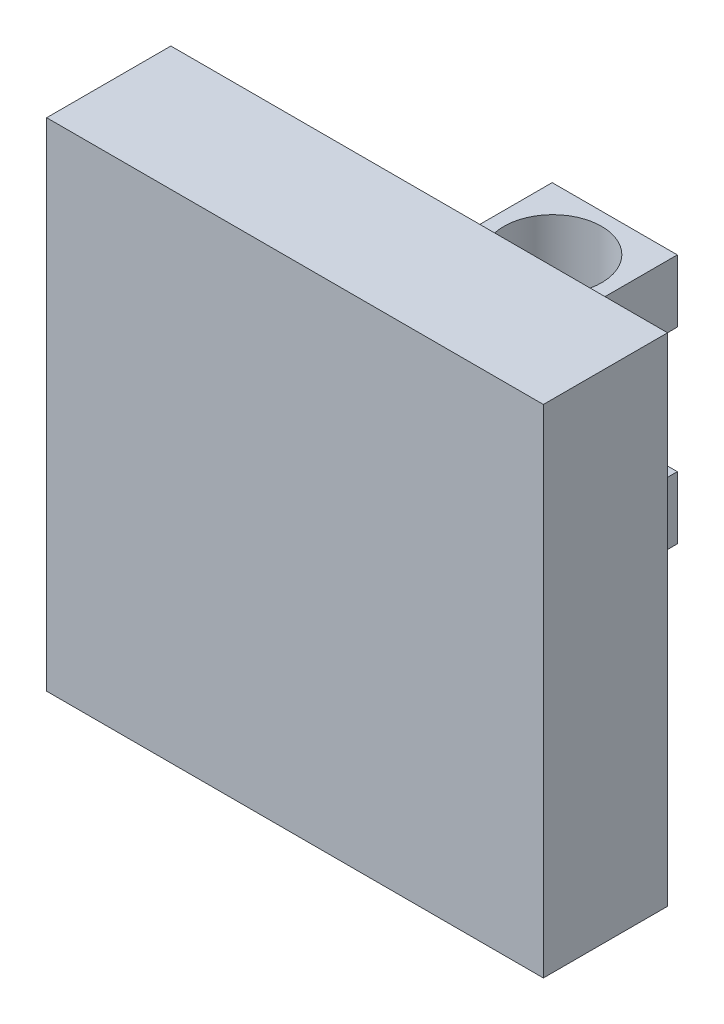
ISO-10303-21;
HEADER;
FILE_DESCRIPTION(('STEP AP214'),'2;1');
FILE_NAME('part.step','',(''),(''),'','','');
FILE_SCHEMA(('AUTOMOTIVE_DESIGN { 1 0 10303 214 1 1 1 1 }'));
ENDSEC;
DATA;
#1=APPLICATION_CONTEXT('core data for automotive mechanical design processes');
#2=APPLICATION_PROTOCOL_DEFINITION('international standard','automotive_design',2000,#1);
#3=PRODUCT_CONTEXT('',#1,'mechanical');
#4=PRODUCT('Part','Part','',(#3));
#5=PRODUCT_RELATED_PRODUCT_CATEGORY('part','',(#4));
#6=PRODUCT_DEFINITION_FORMATION('','',#4);
#7=PRODUCT_DEFINITION_CONTEXT('part definition',#1,'design');
#8=PRODUCT_DEFINITION('design','',#6,#7);
#9=PRODUCT_DEFINITION_SHAPE('','',#8);
#10=(LENGTH_UNIT() NAMED_UNIT(*) SI_UNIT(.MILLI.,.METRE.));
#11=(NAMED_UNIT(*) PLANE_ANGLE_UNIT() SI_UNIT($,.RADIAN.));
#12=(NAMED_UNIT(*) SI_UNIT($,.STERADIAN.) SOLID_ANGLE_UNIT());
#13=UNCERTAINTY_MEASURE_WITH_UNIT(LENGTH_MEASURE(1.E-05),#10,'distance_accuracy_value','');
#14=(GEOMETRIC_REPRESENTATION_CONTEXT(3) GLOBAL_UNCERTAINTY_ASSIGNED_CONTEXT((#13)) GLOBAL_UNIT_ASSIGNED_CONTEXT((#10,
#11,#12)) REPRESENTATION_CONTEXT('',''));
#15=CARTESIAN_POINT('',(0.,0.,0.));
#16=DIRECTION('',(0.,0.,1.));
#17=DIRECTION('',(1.,0.,0.));
#18=AXIS2_PLACEMENT_3D('',#15,#16,#17);
#19=CARTESIAN_POINT('',(0.,0.,0.));
#20=DIRECTION('',(0.,0.,-1.));
#21=DIRECTION('',(-1.,0.,0.));
#22=AXIS2_PLACEMENT_3D('',#19,#20,#21);
#23=PLANE('',#22);
#24=DIRECTION('',(0.,1.,0.));
#25=VECTOR('',#24,1.);
#26=CARTESIAN_POINT('',(12.7,-12.7,0.));
#27=LINE('',#26,#25);
#28=CARTESIAN_POINT('',(12.7,-12.7,0.));
#29=VERTEX_POINT('',#28);
#30=CARTESIAN_POINT('',(12.7,12.7,0.));
#31=VERTEX_POINT('',#30);
#32=EDGE_CURVE('E179',#29,#31,#27,.T.);
#33=ORIENTED_EDGE('',*,*,#32,.F.);
#34=DIRECTION('',(1.,0.,0.));
#35=VECTOR('',#34,1.);
#36=CARTESIAN_POINT('',(-12.7,-12.7,0.));
#37=LINE('',#36,#35);
#38=CARTESIAN_POINT('',(-12.7,-12.7,0.));
#39=VERTEX_POINT('',#38);
#40=EDGE_CURVE('E184',#39,#29,#37,.T.);
#41=ORIENTED_EDGE('',*,*,#40,.F.);
#42=DIRECTION('',(0.,-1.,0.));
#43=VECTOR('',#42,1.);
#44=CARTESIAN_POINT('',(-12.7,-12.7,0.));
#45=LINE('',#44,#43);
#46=CARTESIAN_POINT('',(-12.7,12.7,0.));
#47=VERTEX_POINT('',#46);
#48=EDGE_CURVE('E195',#47,#39,#45,.T.);
#49=ORIENTED_EDGE('',*,*,#48,.F.);
#50=DIRECTION('',(-1.,0.,0.));
#51=VECTOR('',#50,1.);
#52=CARTESIAN_POINT('',(-12.7,12.7,0.));
#53=LINE('',#52,#51);
#54=EDGE_CURVE('E193',#31,#47,#53,.T.);
#55=ORIENTED_EDGE('',*,*,#54,.F.);
#56=EDGE_LOOP('',(#33,#41,#49,#55));
#57=FACE_BOUND('',#56,.T.);
#58=DIRECTION('',(1.,0.,0.));
#59=VECTOR('',#58,1.);
#60=CARTESIAN_POINT('',(3.2,-3.2,0.));
#61=LINE('',#60,#59);
#62=CARTESIAN_POINT('',(-3.2,-3.2,0.));
#63=VERTEX_POINT('',#62);
#64=CARTESIAN_POINT('',(3.2,-3.2,0.));
#65=VERTEX_POINT('',#64);
#66=EDGE_CURVE('E151',#63,#65,#61,.T.);
#67=ORIENTED_EDGE('',*,*,#66,.F.);
#68=DIRECTION('',(0.,1.,0.));
#69=VECTOR('',#68,1.);
#70=CARTESIAN_POINT('',(-3.2,-3.2,0.));
#71=LINE('',#70,#69);
#72=CARTESIAN_POINT('',(-3.2,-6.4,0.));
#73=VERTEX_POINT('',#72);
#74=EDGE_CURVE('E148',#73,#63,#71,.T.);
#75=ORIENTED_EDGE('',*,*,#74,.F.);
#76=DIRECTION('',(-1.,0.,0.));
#77=VECTOR('',#76,1.);
#78=CARTESIAN_POINT('',(-3.2,-6.4,0.));
#79=LINE('',#78,#77);
#80=CARTESIAN_POINT('',(3.2,-6.4,0.));
#81=VERTEX_POINT('',#80);
#82=EDGE_CURVE('E160',#81,#73,#79,.T.);
#83=ORIENTED_EDGE('',*,*,#82,.F.);
#84=DIRECTION('',(0.,-1.,0.));
#85=VECTOR('',#84,1.);
#86=CARTESIAN_POINT('',(3.2,-3.2,0.));
#87=LINE('',#86,#85);
#88=EDGE_CURVE('E168',#65,#81,#87,.T.);
#89=ORIENTED_EDGE('',*,*,#88,.F.);
#90=EDGE_LOOP('',(#67,#75,#83,#89));
#91=FACE_BOUND('',#90,.T.);
#92=DIRECTION('',(0.,1.,0.));
#93=VECTOR('',#92,1.);
#94=CARTESIAN_POINT('',(-3.2,3.2,0.));
#95=LINE('',#94,#93);
#96=CARTESIAN_POINT('',(-3.2,3.2,0.));
#97=VERTEX_POINT('',#96);
#98=CARTESIAN_POINT('',(-3.2,6.4,0.));
#99=VERTEX_POINT('',#98);
#100=EDGE_CURVE('E295',#97,#99,#95,.T.);
#101=ORIENTED_EDGE('',*,*,#100,.F.);
#102=DIRECTION('',(-1.,0.,0.));
#103=VECTOR('',#102,1.);
#104=CARTESIAN_POINT('',(3.2,3.2,0.));
#105=LINE('',#104,#103);
#106=CARTESIAN_POINT('',(3.2,3.2,0.));
#107=VERTEX_POINT('',#106);
#108=EDGE_CURVE('E146',#107,#97,#105,.T.);
#109=ORIENTED_EDGE('',*,*,#108,.F.);
#110=DIRECTION('',(0.,-1.,0.));
#111=VECTOR('',#110,1.);
#112=CARTESIAN_POINT('',(3.2,3.2,0.));
#113=LINE('',#112,#111);
#114=CARTESIAN_POINT('',(3.2,6.4,0.));
#115=VERTEX_POINT('',#114);
#116=EDGE_CURVE('E142',#115,#107,#113,.T.);
#117=ORIENTED_EDGE('',*,*,#116,.F.);
#118=DIRECTION('',(1.,0.,0.));
#119=VECTOR('',#118,1.);
#120=CARTESIAN_POINT('',(3.2,6.4,0.));
#121=LINE('',#120,#119);
#122=EDGE_CURVE('E305',#99,#115,#121,.T.);
#123=ORIENTED_EDGE('',*,*,#122,.F.);
#124=EDGE_LOOP('',(#101,#109,#117,#123));
#125=FACE_BOUND('',#124,.T.);
#126=ADVANCED_FACE('F33',(#57,#91,#125),#23,.T.);
#127=CARTESIAN_POINT('',(12.7,-12.7,6.35));
#128=DIRECTION('',(-1.,0.,0.));
#129=DIRECTION('',(0.,0.,1.));
#130=AXIS2_PLACEMENT_3D('',#127,#128,#129);
#131=PLANE('',#130);
#132=ORIENTED_EDGE('',*,*,#32,.T.);
#133=DIRECTION('',(0.,0.,-1.));
#134=VECTOR('',#133,1.);
#135=CARTESIAN_POINT('',(12.7,12.7,6.35));
#136=LINE('',#135,#134);
#137=CARTESIAN_POINT('',(12.7,12.7,6.35));
#138=VERTEX_POINT('',#137);
#139=EDGE_CURVE('E11',#138,#31,#136,.T.);
#140=ORIENTED_EDGE('',*,*,#139,.F.);
#141=DIRECTION('',(0.,1.,0.));
#142=VECTOR('',#141,1.);
#143=CARTESIAN_POINT('',(12.7,-12.7,6.35));
#144=LINE('',#143,#142);
#145=CARTESIAN_POINT('',(12.7,-12.7,6.35));
#146=VERTEX_POINT('',#145);
#147=EDGE_CURVE('E180',#146,#138,#144,.T.);
#148=ORIENTED_EDGE('',*,*,#147,.F.);
#149=DIRECTION('',(0.,0.,-1.));
#150=VECTOR('',#149,1.);
#151=CARTESIAN_POINT('',(12.7,-12.7,6.35));
#152=LINE('',#151,#150);
#153=EDGE_CURVE('E190',#146,#29,#152,.T.);
#154=ORIENTED_EDGE('',*,*,#153,.T.);
#155=EDGE_LOOP('',(#132,#140,#148,#154));
#156=FACE_BOUND('',#155,.T.);
#157=ADVANCED_FACE('F35',(#156),#131,.F.);
#158=CARTESIAN_POINT('',(-12.7,12.7,6.35));
#159=DIRECTION('',(0.,-1.,0.));
#160=DIRECTION('',(0.,0.,-1.));
#161=AXIS2_PLACEMENT_3D('',#158,#159,#160);
#162=PLANE('',#161);
#163=ORIENTED_EDGE('',*,*,#54,.T.);
#164=DIRECTION('',(0.,0.,-1.));
#165=VECTOR('',#164,1.);
#166=CARTESIAN_POINT('',(-12.7,12.7,6.35));
#167=LINE('',#166,#165);
#168=CARTESIAN_POINT('',(-12.7,12.7,6.35));
#169=VERTEX_POINT('',#168);
#170=EDGE_CURVE('E41',#169,#47,#167,.T.);
#171=ORIENTED_EDGE('',*,*,#170,.F.);
#172=DIRECTION('',(-1.,0.,0.));
#173=VECTOR('',#172,1.);
#174=CARTESIAN_POINT('',(-12.7,12.7,6.35));
#175=LINE('',#174,#173);
#176=EDGE_CURVE('E183',#138,#169,#175,.T.);
#177=ORIENTED_EDGE('',*,*,#176,.F.);
#178=ORIENTED_EDGE('',*,*,#139,.T.);
#179=EDGE_LOOP('',(#163,#171,#177,#178));
#180=FACE_BOUND('',#179,.T.);
#181=ADVANCED_FACE('F223',(#180),#162,.F.);
#182=CARTESIAN_POINT('',(-12.7,-12.7,6.35));
#183=DIRECTION('',(1.,0.,0.));
#184=DIRECTION('',(0.,0.,-1.));
#185=AXIS2_PLACEMENT_3D('',#182,#183,#184);
#186=PLANE('',#185);
#187=ORIENTED_EDGE('',*,*,#48,.T.);
#188=DIRECTION('',(0.,0.,-1.));
#189=VECTOR('',#188,1.);
#190=CARTESIAN_POINT('',(-12.7,-12.7,6.35));
#191=LINE('',#190,#189);
#192=CARTESIAN_POINT('',(-12.7,-12.7,6.35));
#193=VERTEX_POINT('',#192);
#194=EDGE_CURVE('E200',#193,#39,#191,.T.);
#195=ORIENTED_EDGE('',*,*,#194,.F.);
#196=DIRECTION('',(0.,-1.,0.));
#197=VECTOR('',#196,1.);
#198=CARTESIAN_POINT('',(-12.7,-12.7,6.35));
#199=LINE('',#198,#197);
#200=EDGE_CURVE('E186',#169,#193,#199,.T.);
#201=ORIENTED_EDGE('',*,*,#200,.F.);
#202=ORIENTED_EDGE('',*,*,#170,.T.);
#203=EDGE_LOOP('',(#187,#195,#201,#202));
#204=FACE_BOUND('',#203,.T.);
#205=ADVANCED_FACE('F207',(#204),#186,.F.);
#206=CARTESIAN_POINT('',(-12.7,-12.7,6.35));
#207=DIRECTION('',(0.,1.,0.));
#208=DIRECTION('',(0.,0.,1.));
#209=AXIS2_PLACEMENT_3D('',#206,#207,#208);
#210=PLANE('',#209);
#211=ORIENTED_EDGE('',*,*,#40,.T.);
#212=ORIENTED_EDGE('',*,*,#153,.F.);
#213=DIRECTION('',(1.,0.,0.));
#214=VECTOR('',#213,1.);
#215=CARTESIAN_POINT('',(-12.7,-12.7,6.35));
#216=LINE('',#215,#214);
#217=EDGE_CURVE('E188',#193,#146,#216,.T.);
#218=ORIENTED_EDGE('',*,*,#217,.F.);
#219=ORIENTED_EDGE('',*,*,#194,.T.);
#220=EDGE_LOOP('',(#211,#212,#218,#219));
#221=FACE_BOUND('',#220,.T.);
#222=ADVANCED_FACE('F216',(#221),#210,.F.);
#223=CARTESIAN_POINT('',(0.,0.,6.35));
#224=DIRECTION('',(0.,0.,-1.));
#225=DIRECTION('',(-1.,0.,0.));
#226=AXIS2_PLACEMENT_3D('',#223,#224,#225);
#227=PLANE('',#226);
#228=ORIENTED_EDGE('',*,*,#147,.T.);
#229=ORIENTED_EDGE('',*,*,#176,.T.);
#230=ORIENTED_EDGE('',*,*,#200,.T.);
#231=ORIENTED_EDGE('',*,*,#217,.T.);
#232=EDGE_LOOP('',(#228,#229,#230,#231));
#233=FACE_BOUND('',#232,.T.);
#234=ADVANCED_FACE('F222',(#233),#227,.F.);
#235=CARTESIAN_POINT('',(-3.2,-3.2,-10.));
#236=DIRECTION('',(1.,0.,0.));
#237=DIRECTION('',(0.,1.,0.));
#238=AXIS2_PLACEMENT_3D('',#235,#236,#237);
#239=PLANE('',#238);
#240=ORIENTED_EDGE('',*,*,#74,.T.);
#241=DIRECTION('',(0.,0.,1.));
#242=VECTOR('',#241,1.);
#243=CARTESIAN_POINT('',(-3.2,-3.2,-10.));
#244=LINE('',#243,#242);
#245=CARTESIAN_POINT('',(-3.2,-3.2,-10.));
#246=VERTEX_POINT('',#245);
#247=EDGE_CURVE('E177',#246,#63,#244,.T.);
#248=ORIENTED_EDGE('',*,*,#247,.F.);
#249=DIRECTION('',(0.,1.,0.));
#250=VECTOR('',#249,1.);
#251=CARTESIAN_POINT('',(-3.2,-3.2,-10.));
#252=LINE('',#251,#250);
#253=CARTESIAN_POINT('',(-3.2,-6.4,-10.));
#254=VERTEX_POINT('',#253);
#255=EDGE_CURVE('E156',#254,#246,#252,.T.);
#256=ORIENTED_EDGE('',*,*,#255,.F.);
#257=DIRECTION('',(0.,0.,1.));
#258=VECTOR('',#257,1.);
#259=CARTESIAN_POINT('',(-3.2,-6.4,-10.));
#260=LINE('',#259,#258);
#261=EDGE_CURVE('E165',#254,#73,#260,.T.);
#262=ORIENTED_EDGE('',*,*,#261,.T.);
#263=EDGE_LOOP('',(#240,#248,#256,#262));
#264=FACE_BOUND('',#263,.T.);
#265=ADVANCED_FACE('F241',(#264),#239,.F.);
#266=CARTESIAN_POINT('',(3.2,-3.2,-10.));
#267=DIRECTION('',(0.,-1.,0.));
#268=DIRECTION('',(0.,0.,-1.));
#269=AXIS2_PLACEMENT_3D('',#266,#267,#268);
#270=PLANE('',#269);
#271=CARTESIAN_POINT('',(0.,-3.2,-6.83038560737259));
#272=DIRECTION('',(0.,-1.,0.));
#273=DIRECTION('',(0.,0.,-1.));
#274=AXIS2_PLACEMENT_3D('',#271,#272,#273);
#275=CIRCLE('',#274,2.498733);
#276=CARTESIAN_POINT('',(0.,-3.2,-9.32911860737259));
#277=VERTEX_POINT('',#276);
#278=EDGE_CURVE('E293',#277,#277,#275,.T.);
#279=ORIENTED_EDGE('',*,*,#278,.T.);
#280=EDGE_LOOP('',(#279));
#281=FACE_BOUND('',#280,.T.);
#282=ORIENTED_EDGE('',*,*,#66,.T.);
#283=DIRECTION('',(0.,0.,1.));
#284=VECTOR('',#283,1.);
#285=CARTESIAN_POINT('',(3.2,-3.2,-10.));
#286=LINE('',#285,#284);
#287=CARTESIAN_POINT('',(3.2,-3.2,-10.));
#288=VERTEX_POINT('',#287);
#289=EDGE_CURVE('E174',#288,#65,#286,.T.);
#290=ORIENTED_EDGE('',*,*,#289,.F.);
#291=DIRECTION('',(1.,0.,0.));
#292=VECTOR('',#291,1.);
#293=CARTESIAN_POINT('',(3.2,-3.2,-10.));
#294=LINE('',#293,#292);
#295=EDGE_CURVE('E159',#246,#288,#294,.T.);
#296=ORIENTED_EDGE('',*,*,#295,.F.);
#297=ORIENTED_EDGE('',*,*,#247,.T.);
#298=EDGE_LOOP('',(#282,#290,#296,#297));
#299=FACE_BOUND('',#298,.T.);
#300=ADVANCED_FACE('F245',(#281,#299),#270,.F.);
#301=CARTESIAN_POINT('',(3.2,-3.2,-10.));
#302=DIRECTION('',(-1.,0.,0.));
#303=DIRECTION('',(0.,-1.,0.));
#304=AXIS2_PLACEMENT_3D('',#301,#302,#303);
#305=PLANE('',#304);
#306=ORIENTED_EDGE('',*,*,#88,.T.);
#307=DIRECTION('',(0.,0.,1.));
#308=VECTOR('',#307,1.);
#309=CARTESIAN_POINT('',(3.2,-6.4,-10.));
#310=LINE('',#309,#308);
#311=CARTESIAN_POINT('',(3.2,-6.4,-10.));
#312=VERTEX_POINT('',#311);
#313=EDGE_CURVE('E56',#312,#81,#310,.T.);
#314=ORIENTED_EDGE('',*,*,#313,.F.);
#315=DIRECTION('',(0.,-1.,0.));
#316=VECTOR('',#315,1.);
#317=CARTESIAN_POINT('',(3.2,-3.2,-10.));
#318=LINE('',#317,#316);
#319=EDGE_CURVE('E162',#288,#312,#318,.T.);
#320=ORIENTED_EDGE('',*,*,#319,.F.);
#321=ORIENTED_EDGE('',*,*,#289,.T.);
#322=EDGE_LOOP('',(#306,#314,#320,#321));
#323=FACE_BOUND('',#322,.T.);
#324=ADVANCED_FACE('F250',(#323),#305,.F.);
#325=CARTESIAN_POINT('',(-3.2,-6.4,-10.));
#326=DIRECTION('',(0.,1.,0.));
#327=DIRECTION('',(0.,0.,1.));
#328=AXIS2_PLACEMENT_3D('',#325,#326,#327);
#329=PLANE('',#328);
#330=CARTESIAN_POINT('',(0.,-6.4,-6.83038560737259));
#331=DIRECTION('',(0.,1.,0.));
#332=DIRECTION('',(0.,0.,1.));
#333=AXIS2_PLACEMENT_3D('',#330,#331,#332);
#334=CIRCLE('',#333,2.498733);
#335=CARTESIAN_POINT('',(0.,-6.4,-4.33165260737259));
#336=VERTEX_POINT('',#335);
#337=EDGE_CURVE('E290',#336,#336,#334,.T.);
#338=ORIENTED_EDGE('',*,*,#337,.T.);
#339=EDGE_LOOP('',(#338));
#340=FACE_BOUND('',#339,.T.);
#341=ORIENTED_EDGE('',*,*,#82,.T.);
#342=ORIENTED_EDGE('',*,*,#261,.F.);
#343=DIRECTION('',(-1.,0.,0.));
#344=VECTOR('',#343,1.);
#345=CARTESIAN_POINT('',(-3.2,-6.4,-10.));
#346=LINE('',#345,#344);
#347=EDGE_CURVE('E164',#312,#254,#346,.T.);
#348=ORIENTED_EDGE('',*,*,#347,.F.);
#349=ORIENTED_EDGE('',*,*,#313,.T.);
#350=EDGE_LOOP('',(#341,#342,#348,#349));
#351=FACE_BOUND('',#350,.T.);
#352=ADVANCED_FACE('F256',(#340,#351),#329,.F.);
#353=CARTESIAN_POINT('',(0.,0.,-10.));
#354=DIRECTION('',(0.,0.,1.));
#355=DIRECTION('',(1.,0.,0.));
#356=AXIS2_PLACEMENT_3D('',#353,#354,#355);
#357=PLANE('',#356);
#358=ORIENTED_EDGE('',*,*,#255,.T.);
#359=ORIENTED_EDGE('',*,*,#295,.T.);
#360=ORIENTED_EDGE('',*,*,#319,.T.);
#361=ORIENTED_EDGE('',*,*,#347,.T.);
#362=EDGE_LOOP('',(#358,#359,#360,#361));
#363=FACE_BOUND('',#362,.T.);
#364=ADVANCED_FACE('F260',(#363),#357,.F.);
#365=CARTESIAN_POINT('',(3.2,3.2,-10.));
#366=DIRECTION('',(0.,1.,0.));
#367=DIRECTION('',(0.,0.,1.));
#368=AXIS2_PLACEMENT_3D('',#365,#366,#367);
#369=PLANE('',#368);
#370=CARTESIAN_POINT('',(0.,3.2,-6.83038560737259));
#371=DIRECTION('',(0.,1.,0.));
#372=DIRECTION('',(0.,0.,1.));
#373=AXIS2_PLACEMENT_3D('',#370,#371,#372);
#374=CIRCLE('',#373,2.498733);
#375=CARTESIAN_POINT('',(0.,3.2,-4.33165260737259));
#376=VERTEX_POINT('',#375);
#377=EDGE_CURVE('E297',#376,#376,#374,.T.);
#378=ORIENTED_EDGE('',*,*,#377,.T.);
#379=EDGE_LOOP('',(#378));
#380=FACE_BOUND('',#379,.T.);
#381=ORIENTED_EDGE('',*,*,#108,.T.);
#382=DIRECTION('',(0.,0.,1.));
#383=VECTOR('',#382,1.);
#384=CARTESIAN_POINT('',(-3.2,3.2,-10.));
#385=LINE('',#384,#383);
#386=CARTESIAN_POINT('',(-3.2,3.2,-10.));
#387=VERTEX_POINT('',#386);
#388=EDGE_CURVE('E127',#387,#97,#385,.T.);
#389=ORIENTED_EDGE('',*,*,#388,.F.);
#390=DIRECTION('',(-1.,0.,0.));
#391=VECTOR('',#390,1.);
#392=CARTESIAN_POINT('',(3.2,3.2,-10.));
#393=LINE('',#392,#391);
#394=CARTESIAN_POINT('',(3.2,3.2,-10.));
#395=VERTEX_POINT('',#394);
#396=EDGE_CURVE('E134',#395,#387,#393,.T.);
#397=ORIENTED_EDGE('',*,*,#396,.F.);
#398=DIRECTION('',(0.,0.,1.));
#399=VECTOR('',#398,1.);
#400=CARTESIAN_POINT('',(3.2,3.2,-10.));
#401=LINE('',#400,#399);
#402=EDGE_CURVE('E302',#395,#107,#401,.T.);
#403=ORIENTED_EDGE('',*,*,#402,.T.);
#404=EDGE_LOOP('',(#381,#389,#397,#403));
#405=FACE_BOUND('',#404,.T.);
#406=ADVANCED_FACE('F144',(#380,#405),#369,.F.);
#407=CARTESIAN_POINT('',(-3.2,3.2,-10.));
#408=DIRECTION('',(1.,0.,0.));
#409=DIRECTION('',(0.,0.,-1.));
#410=AXIS2_PLACEMENT_3D('',#407,#408,#409);
#411=PLANE('',#410);
#412=ORIENTED_EDGE('',*,*,#100,.T.);
#413=DIRECTION('',(0.,0.,1.));
#414=VECTOR('',#413,1.);
#415=CARTESIAN_POINT('',(-3.2,6.4,-10.));
#416=LINE('',#415,#414);
#417=CARTESIAN_POINT('',(-3.2,6.4,-10.));
#418=VERTEX_POINT('',#417);
#419=EDGE_CURVE('E130',#418,#99,#416,.T.);
#420=ORIENTED_EDGE('',*,*,#419,.F.);
#421=DIRECTION('',(0.,1.,0.));
#422=VECTOR('',#421,1.);
#423=CARTESIAN_POINT('',(-3.2,3.2,-10.));
#424=LINE('',#423,#422);
#425=EDGE_CURVE('E123',#387,#418,#424,.T.);
#426=ORIENTED_EDGE('',*,*,#425,.F.);
#427=ORIENTED_EDGE('',*,*,#388,.T.);
#428=EDGE_LOOP('',(#412,#420,#426,#427));
#429=FACE_BOUND('',#428,.T.);
#430=ADVANCED_FACE('F125',(#429),#411,.F.);
#431=CARTESIAN_POINT('',(3.2,6.4,-10.));
#432=DIRECTION('',(0.,-1.,0.));
#433=DIRECTION('',(0.,0.,-1.));
#434=AXIS2_PLACEMENT_3D('',#431,#432,#433);
#435=PLANE('',#434);
#436=CARTESIAN_POINT('',(0.,6.4,-6.83038560737259));
#437=DIRECTION('',(0.,1.,0.));
#438=DIRECTION('',(0.,0.,1.));
#439=AXIS2_PLACEMENT_3D('',#436,#437,#438);
#440=CIRCLE('',#439,2.498733);
#441=CARTESIAN_POINT('',(0.,6.4,-4.33165260737259));
#442=VERTEX_POINT('',#441);
#443=EDGE_CURVE('E314',#442,#442,#440,.T.);
#444=ORIENTED_EDGE('',*,*,#443,.F.);
#445=EDGE_LOOP('',(#444));
#446=FACE_BOUND('',#445,.T.);
#447=ORIENTED_EDGE('',*,*,#122,.T.);
#448=DIRECTION('',(0.,0.,1.));
#449=VECTOR('',#448,1.);
#450=CARTESIAN_POINT('',(3.2,6.4,-10.));
#451=LINE('',#450,#449);
#452=CARTESIAN_POINT('',(3.2,6.4,-10.));
#453=VERTEX_POINT('',#452);
#454=EDGE_CURVE('E48',#453,#115,#451,.T.);
#455=ORIENTED_EDGE('',*,*,#454,.F.);
#456=DIRECTION('',(1.,0.,0.));
#457=VECTOR('',#456,1.);
#458=CARTESIAN_POINT('',(3.2,6.4,-10.));
#459=LINE('',#458,#457);
#460=EDGE_CURVE('E133',#418,#453,#459,.T.);
#461=ORIENTED_EDGE('',*,*,#460,.F.);
#462=ORIENTED_EDGE('',*,*,#419,.T.);
#463=EDGE_LOOP('',(#447,#455,#461,#462));
#464=FACE_BOUND('',#463,.T.);
#465=ADVANCED_FACE('F270',(#446,#464),#435,.F.);
#466=CARTESIAN_POINT('',(3.2,3.2,-10.));
#467=DIRECTION('',(-1.,0.,0.));
#468=DIRECTION('',(0.,0.,1.));
#469=AXIS2_PLACEMENT_3D('',#466,#467,#468);
#470=PLANE('',#469);
#471=ORIENTED_EDGE('',*,*,#116,.T.);
#472=ORIENTED_EDGE('',*,*,#402,.F.);
#473=DIRECTION('',(0.,-1.,0.));
#474=VECTOR('',#473,1.);
#475=CARTESIAN_POINT('',(3.2,3.2,-10.));
#476=LINE('',#475,#474);
#477=EDGE_CURVE('E138',#453,#395,#476,.T.);
#478=ORIENTED_EDGE('',*,*,#477,.F.);
#479=ORIENTED_EDGE('',*,*,#454,.T.);
#480=EDGE_LOOP('',(#471,#472,#478,#479));
#481=FACE_BOUND('',#480,.T.);
#482=ADVANCED_FACE('F273',(#481),#470,.F.);
#483=CARTESIAN_POINT('',(0.,0.,-10.));
#484=DIRECTION('',(0.,0.,-1.));
#485=DIRECTION('',(-1.,0.,0.));
#486=AXIS2_PLACEMENT_3D('',#483,#484,#485);
#487=PLANE('',#486);
#488=ORIENTED_EDGE('',*,*,#396,.T.);
#489=ORIENTED_EDGE('',*,*,#425,.T.);
#490=ORIENTED_EDGE('',*,*,#460,.T.);
#491=ORIENTED_EDGE('',*,*,#477,.T.);
#492=EDGE_LOOP('',(#488,#489,#490,#491));
#493=FACE_BOUND('',#492,.T.);
#494=ADVANCED_FACE('F137',(#493),#487,.T.);
#495=CARTESIAN_POINT('',(0.,-12.7,-6.83038560737259));
#496=DIRECTION('',(0.,1.,0.));
#497=DIRECTION('',(0.,0.,1.));
#498=AXIS2_PLACEMENT_3D('',#495,#496,#497);
#499=CYLINDRICAL_SURFACE('',#498,2.498733);
#500=ORIENTED_EDGE('',*,*,#443,.T.);
#501=EDGE_LOOP('',(#500));
#502=FACE_BOUND('',#501,.T.);
#503=ORIENTED_EDGE('',*,*,#377,.F.);
#504=EDGE_LOOP('',(#503));
#505=FACE_BOUND('',#504,.T.);
#506=ADVANCED_FACE('F279',(#502,#505),#499,.F.);
#507=ORIENTED_EDGE('',*,*,#337,.F.);
#508=EDGE_LOOP('',(#507));
#509=FACE_BOUND('',#508,.T.);
#510=ORIENTED_EDGE('',*,*,#278,.F.);
#511=EDGE_LOOP('',(#510));
#512=FACE_BOUND('',#511,.T.);
#513=ADVANCED_FACE('F280',(#509,#512),#499,.F.);
#514=CLOSED_SHELL('',(#126,#157,#181,#205,#222,#234,#265,#300,#324,#352,#364,#406,#430,#465,
#482,#494,#506,#513));
#515=MANIFOLD_SOLID_BREP('B2',#514);
#516=ADVANCED_BREP_SHAPE_REPRESENTATION('',(#18,#515),#14);
#517=SHAPE_DEFINITION_REPRESENTATION(#9,#516);
ENDSEC;
END-ISO-10303-21;
